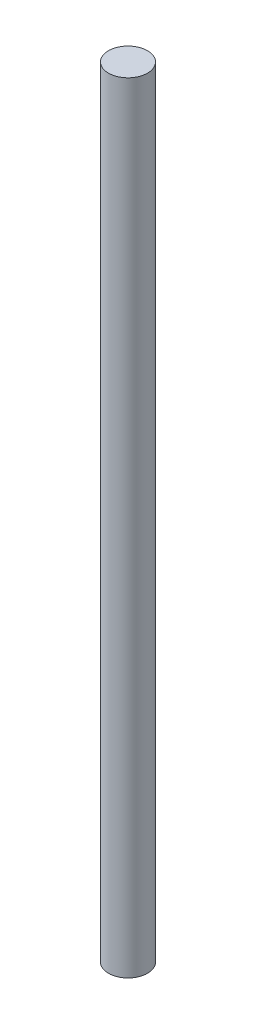
ISO-10303-21;
HEADER;
FILE_DESCRIPTION(('STEP AP214'),'2;1');
FILE_NAME('part.step','',(''),(''),'','','');
FILE_SCHEMA(('AUTOMOTIVE_DESIGN { 1 0 10303 214 1 1 1 1 }'));
ENDSEC;
DATA;
#1=APPLICATION_CONTEXT('core data for automotive mechanical design processes');
#2=APPLICATION_PROTOCOL_DEFINITION('international standard','automotive_design',2000,#1);
#3=PRODUCT_CONTEXT('',#1,'mechanical');
#4=PRODUCT('Part','Part','',(#3));
#5=PRODUCT_RELATED_PRODUCT_CATEGORY('part','',(#4));
#6=PRODUCT_DEFINITION_FORMATION('','',#4);
#7=PRODUCT_DEFINITION_CONTEXT('part definition',#1,'design');
#8=PRODUCT_DEFINITION('design','',#6,#7);
#9=PRODUCT_DEFINITION_SHAPE('','',#8);
#10=(LENGTH_UNIT() NAMED_UNIT(*) SI_UNIT(.MILLI.,.METRE.));
#11=(NAMED_UNIT(*) PLANE_ANGLE_UNIT() SI_UNIT($,.RADIAN.));
#12=(NAMED_UNIT(*) SI_UNIT($,.STERADIAN.) SOLID_ANGLE_UNIT());
#13=UNCERTAINTY_MEASURE_WITH_UNIT(LENGTH_MEASURE(1.E-05),#10,'distance_accuracy_value','');
#14=(GEOMETRIC_REPRESENTATION_CONTEXT(3) GLOBAL_UNCERTAINTY_ASSIGNED_CONTEXT((#13)) GLOBAL_UNIT_ASSIGNED_CONTEXT((#10,
#11,#12)) REPRESENTATION_CONTEXT('',''));
#15=CARTESIAN_POINT('',(0.,0.,0.));
#16=DIRECTION('',(0.,0.,1.));
#17=DIRECTION('',(1.,0.,0.));
#18=AXIS2_PLACEMENT_3D('',#15,#16,#17);
#19=CARTESIAN_POINT('',(0.,254.,0.));
#20=DIRECTION('',(0.,-1.,0.));
#21=DIRECTION('',(0.,0.,-1.));
#22=AXIS2_PLACEMENT_3D('',#19,#20,#21);
#23=CYLINDRICAL_SURFACE('',#22,6.35);
#24=CARTESIAN_POINT('',(0.,254.,0.));
#25=DIRECTION('',(0.,1.,0.));
#26=DIRECTION('',(0.,0.,1.));
#27=AXIS2_PLACEMENT_3D('',#24,#25,#26);
#28=CIRCLE('',#27,6.35);
#29=CARTESIAN_POINT('',(0.,254.,6.35));
#30=VERTEX_POINT('',#29);
#31=EDGE_CURVE('E10',#30,#30,#28,.T.);
#32=ORIENTED_EDGE('',*,*,#31,.F.);
#33=EDGE_LOOP('',(#32));
#34=FACE_BOUND('',#33,.T.);
#35=CARTESIAN_POINT('',(0.,0.,0.));
#36=DIRECTION('',(0.,1.,0.));
#37=DIRECTION('',(0.,0.,1.));
#38=AXIS2_PLACEMENT_3D('',#35,#36,#37);
#39=CIRCLE('',#38,6.35);
#40=CARTESIAN_POINT('',(0.,0.,6.35));
#41=VERTEX_POINT('',#40);
#42=EDGE_CURVE('E34',#41,#41,#39,.T.);
#43=ORIENTED_EDGE('',*,*,#42,.T.);
#44=EDGE_LOOP('',(#43));
#45=FACE_BOUND('',#44,.T.);
#46=ADVANCED_FACE('F31',(#34,#45),#23,.T.);
#47=CARTESIAN_POINT('',(0.,254.,0.));
#48=DIRECTION('',(0.,1.,0.));
#49=DIRECTION('',(0.,0.,1.));
#50=AXIS2_PLACEMENT_3D('',#47,#48,#49);
#51=PLANE('',#50);
#52=ORIENTED_EDGE('',*,*,#31,.T.);
#53=EDGE_LOOP('',(#52));
#54=FACE_BOUND('',#53,.T.);
#55=ADVANCED_FACE('F46',(#54),#51,.T.);
#56=CARTESIAN_POINT('',(0.,0.,0.));
#57=DIRECTION('',(0.,1.,0.));
#58=DIRECTION('',(0.,0.,1.));
#59=AXIS2_PLACEMENT_3D('',#56,#57,#58);
#60=PLANE('',#59);
#61=ORIENTED_EDGE('',*,*,#42,.F.);
#62=EDGE_LOOP('',(#61));
#63=FACE_BOUND('',#62,.T.);
#64=ADVANCED_FACE('F44',(#63),#60,.F.);
#65=CLOSED_SHELL('',(#46,#55,#64));
#66=MANIFOLD_SOLID_BREP('B2',#65);
#67=ADVANCED_BREP_SHAPE_REPRESENTATION('',(#18,#66),#14);
#68=SHAPE_DEFINITION_REPRESENTATION(#9,#67);
ENDSEC;
END-ISO-10303-21;
